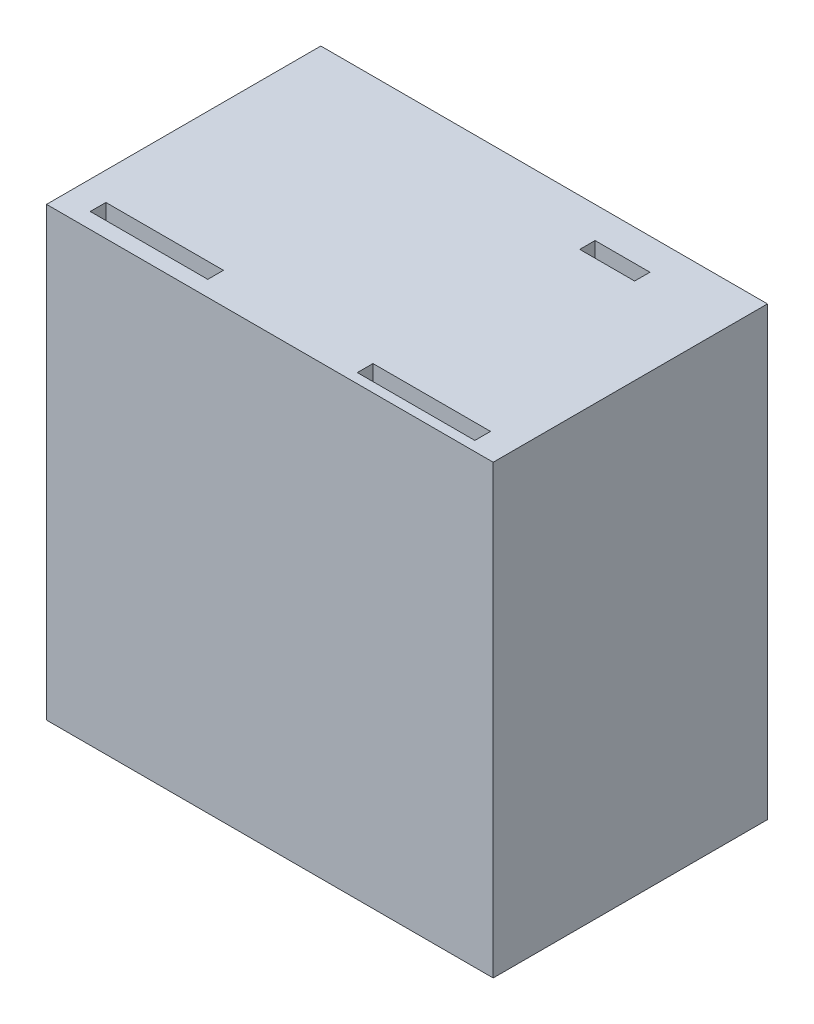
ISO-10303-21;
HEADER;
FILE_DESCRIPTION(('STEP AP214'),'2;1');
FILE_NAME('part.step','',(''),(''),'','','');
FILE_SCHEMA(('AUTOMOTIVE_DESIGN { 1 0 10303 214 1 1 1 1 }'));
ENDSEC;
DATA;
#1=APPLICATION_CONTEXT('core data for automotive mechanical design processes');
#2=APPLICATION_PROTOCOL_DEFINITION('international standard','automotive_design',2000,#1);
#3=PRODUCT_CONTEXT('',#1,'mechanical');
#4=PRODUCT('Part','Part','',(#3));
#5=PRODUCT_RELATED_PRODUCT_CATEGORY('part','',(#4));
#6=PRODUCT_DEFINITION_FORMATION('','',#4);
#7=PRODUCT_DEFINITION_CONTEXT('part definition',#1,'design');
#8=PRODUCT_DEFINITION('design','',#6,#7);
#9=PRODUCT_DEFINITION_SHAPE('','',#8);
#10=(LENGTH_UNIT() NAMED_UNIT(*) SI_UNIT(.MILLI.,.METRE.));
#11=(NAMED_UNIT(*) PLANE_ANGLE_UNIT() SI_UNIT($,.RADIAN.));
#12=(NAMED_UNIT(*) SI_UNIT($,.STERADIAN.) SOLID_ANGLE_UNIT());
#13=UNCERTAINTY_MEASURE_WITH_UNIT(LENGTH_MEASURE(1.E-05),#10,'distance_accuracy_value','');
#14=(GEOMETRIC_REPRESENTATION_CONTEXT(3) GLOBAL_UNCERTAINTY_ASSIGNED_CONTEXT((#13)) GLOBAL_UNIT_ASSIGNED_CONTEXT((#10,
#11,#12)) REPRESENTATION_CONTEXT('',''));
#15=CARTESIAN_POINT('',(0.,0.,0.));
#16=DIRECTION('',(0.,0.,1.));
#17=DIRECTION('',(1.,0.,0.));
#18=AXIS2_PLACEMENT_3D('',#15,#16,#17);
#19=CARTESIAN_POINT('',(0.,0.,0.));
#20=DIRECTION('',(0.,0.,1.));
#21=DIRECTION('',(1.,0.,0.));
#22=AXIS2_PLACEMENT_3D('',#19,#20,#21);
#23=PLANE('',#22);
#24=DIRECTION('',(0.,1.,0.));
#25=VECTOR('',#24,1.);
#26=CARTESIAN_POINT('',(-14.2330097087379,-26.7378640776699,0.));
#27=LINE('',#26,#25);
#28=CARTESIAN_POINT('',(-14.2330097087379,-29.2378640776699,0.));
#29=VERTEX_POINT('',#28);
#30=CARTESIAN_POINT('',(-14.2330097087379,-21.7378640776699,0.));
#31=VERTEX_POINT('',#30);
#32=EDGE_CURVE('E295',#29,#31,#27,.T.);
#33=ORIENTED_EDGE('',*,*,#32,.F.);
#34=DIRECTION('',(1.,0.,0.));
#35=VECTOR('',#34,1.);
#36=CARTESIAN_POINT('',(-34.2330097087379,-29.2378640776699,0.));
#37=LINE('',#36,#35);
#38=CARTESIAN_POINT('',(-34.2330097087379,-29.2378640776699,0.));
#39=VERTEX_POINT('',#38);
#40=EDGE_CURVE('E417',#39,#29,#37,.T.);
#41=ORIENTED_EDGE('',*,*,#40,.F.);
#42=DIRECTION('',(0.,-1.,0.));
#43=VECTOR('',#42,1.);
#44=CARTESIAN_POINT('',(-34.2330097087379,27.7621359223301,0.));
#45=LINE('',#44,#43);
#46=CARTESIAN_POINT('',(-34.2330097087379,-9.23786407766991,0.));
#47=VERTEX_POINT('',#46);
#48=EDGE_CURVE('E401',#47,#39,#45,.T.);
#49=ORIENTED_EDGE('',*,*,#48,.F.);
#50=DIRECTION('',(1.,0.,0.));
#51=VECTOR('',#50,1.);
#52=CARTESIAN_POINT('',(-36.7330097087378,-9.23786407766991,0.));
#53=LINE('',#52,#51);
#54=CARTESIAN_POINT('',(-26.7330097087379,-9.23786407766991,0.));
#55=VERTEX_POINT('',#54);
#56=EDGE_CURVE('E271',#47,#55,#53,.T.);
#57=ORIENTED_EDGE('',*,*,#56,.T.);
#58=DIRECTION('',(0.,1.,0.));
#59=VECTOR('',#58,1.);
#60=CARTESIAN_POINT('',(-26.7330097087379,20.2621359223301,0.));
#61=LINE('',#60,#59);
#62=CARTESIAN_POINT('',(-26.7330097087379,-21.7378640776699,0.));
#63=VERTEX_POINT('',#62);
#64=EDGE_CURVE('E322',#63,#55,#61,.T.);
#65=ORIENTED_EDGE('',*,*,#64,.F.);
#66=DIRECTION('',(-1.,0.,0.));
#67=VECTOR('',#66,1.);
#68=CARTESIAN_POINT('',(15.2669902912621,-21.7378640776699,0.));
#69=LINE('',#68,#67);
#70=EDGE_CURVE('E317',#31,#63,#69,.T.);
#71=ORIENTED_EDGE('',*,*,#70,.F.);
#72=EDGE_LOOP('',(#33,#41,#49,#57,#65,#71));
#73=FACE_BOUND('',#72,.T.);
#74=ADVANCED_FACE('F36',(#73),#23,.F.);
#75=CARTESIAN_POINT('',(-34.2330097087379,27.7621359223301,35.));
#76=DIRECTION('',(1.,0.,0.));
#77=DIRECTION('',(0.,0.,-1.));
#78=AXIS2_PLACEMENT_3D('',#75,#76,#77);
#79=PLANE('',#78);
#80=CARTESIAN_POINT('',(-34.2330097087379,27.7621359223301,0.));
#81=VERTEX_POINT('',#80);
#82=CARTESIAN_POINT('',(-34.2330097087379,7.7621359223301,0.));
#83=VERTEX_POINT('',#82);
#84=EDGE_CURVE('E413',#81,#83,#45,.T.);
#85=ORIENTED_EDGE('',*,*,#84,.T.);
#86=DIRECTION('',(0.,0.,1.));
#87=VECTOR('',#86,1.);
#88=CARTESIAN_POINT('',(-34.2330097087379,7.76213592233009,35.));
#89=LINE('',#88,#87);
#90=CARTESIAN_POINT('',(-34.2330097087379,7.7621359223301,11.));
#91=VERTEX_POINT('',#90);
#92=EDGE_CURVE('E278',#83,#91,#89,.T.);
#93=ORIENTED_EDGE('',*,*,#92,.T.);
#94=CARTESIAN_POINT('',(-34.2330097087379,-0.737864077669904,11.));
#95=DIRECTION('',(1.,0.,0.));
#96=DIRECTION('',(0.,0.,-1.));
#97=AXIS2_PLACEMENT_3D('',#94,#95,#96);
#98=CIRCLE('',#97,8.5);
#99=CARTESIAN_POINT('',(-34.2330097087379,-9.23786407766991,11.));
#100=VERTEX_POINT('',#99);
#101=EDGE_CURVE('E281',#91,#100,#98,.T.);
#102=ORIENTED_EDGE('',*,*,#101,.T.);
#103=DIRECTION('',(0.,0.,-1.));
#104=VECTOR('',#103,1.);
#105=CARTESIAN_POINT('',(-34.2330097087379,-9.23786407766991,35.));
#106=LINE('',#105,#104);
#107=EDGE_CURVE('E268',#100,#47,#106,.T.);
#108=ORIENTED_EDGE('',*,*,#107,.T.);
#109=ORIENTED_EDGE('',*,*,#48,.T.);
#110=DIRECTION('',(0.,0.,-1.));
#111=VECTOR('',#110,1.);
#112=CARTESIAN_POINT('',(-34.2330097087379,-29.2378640776699,35.));
#113=LINE('',#112,#111);
#114=CARTESIAN_POINT('',(-34.2330097087379,-29.2378640776699,35.));
#115=VERTEX_POINT('',#114);
#116=EDGE_CURVE('E431',#115,#39,#113,.T.);
#117=ORIENTED_EDGE('',*,*,#116,.F.);
#118=DIRECTION('',(0.,-1.,0.));
#119=VECTOR('',#118,1.);
#120=CARTESIAN_POINT('',(-34.2330097087379,27.7621359223301,35.));
#121=LINE('',#120,#119);
#122=CARTESIAN_POINT('',(-34.2330097087379,27.7621359223301,35.));
#123=VERTEX_POINT('',#122);
#124=EDGE_CURVE('E402',#123,#115,#121,.T.);
#125=ORIENTED_EDGE('',*,*,#124,.F.);
#126=DIRECTION('',(0.,0.,-1.));
#127=VECTOR('',#126,1.);
#128=CARTESIAN_POINT('',(-34.2330097087379,27.7621359223301,35.));
#129=LINE('',#128,#127);
#130=EDGE_CURVE('E412',#123,#81,#129,.T.);
#131=ORIENTED_EDGE('',*,*,#130,.T.);
#132=EDGE_LOOP('',(#85,#93,#102,#108,#109,#117,#125,#131));
#133=FACE_BOUND('',#132,.T.);
#134=ADVANCED_FACE('F38',(#133),#79,.F.);
#135=CARTESIAN_POINT('',(-34.2330097087379,-29.2378640776699,35.));
#136=DIRECTION('',(0.,1.,0.));
#137=DIRECTION('',(0.,0.,1.));
#138=AXIS2_PLACEMENT_3D('',#135,#136,#137);
#139=PLANE('',#138);
#140=DIRECTION('',(-1.,0.,0.));
#141=VECTOR('',#140,1.);
#142=CARTESIAN_POINT('',(-34.2330097087379,-29.2378640776699,31.));
#143=LINE('',#142,#141);
#144=CARTESIAN_POINT('',(-15.6564162838043,-29.2378640776699,31.));
#145=VERTEX_POINT('',#144);
#146=CARTESIAN_POINT('',(-30.6564162838043,-29.2378640776699,31.));
#147=VERTEX_POINT('',#146);
#148=EDGE_CURVE('E395',#145,#147,#143,.T.);
#149=ORIENTED_EDGE('',*,*,#148,.T.);
#150=DIRECTION('',(0.,0.,1.));
#151=VECTOR('',#150,1.);
#152=CARTESIAN_POINT('',(-30.6564162838043,-29.2378640776699,35.));
#153=LINE('',#152,#151);
#154=CARTESIAN_POINT('',(-30.6564162838043,-29.2378640776699,33.));
#155=VERTEX_POINT('',#154);
#156=EDGE_CURVE('E398',#147,#155,#153,.T.);
#157=ORIENTED_EDGE('',*,*,#156,.T.);
#158=DIRECTION('',(1.,0.,0.));
#159=VECTOR('',#158,1.);
#160=CARTESIAN_POINT('',(-34.2330097087379,-29.2378640776699,33.));
#161=LINE('',#160,#159);
#162=CARTESIAN_POINT('',(-15.6564162838043,-29.2378640776699,33.));
#163=VERTEX_POINT('',#162);
#164=EDGE_CURVE('E389',#155,#163,#161,.T.);
#165=ORIENTED_EDGE('',*,*,#164,.T.);
#166=DIRECTION('',(0.,0.,-1.));
#167=VECTOR('',#166,1.);
#168=CARTESIAN_POINT('',(-15.6564162838043,-29.2378640776699,35.));
#169=LINE('',#168,#167);
#170=EDGE_CURVE('E392',#163,#145,#169,.T.);
#171=ORIENTED_EDGE('',*,*,#170,.T.);
#172=EDGE_LOOP('',(#149,#157,#165,#171));
#173=FACE_BOUND('',#172,.T.);
#174=DIRECTION('',(-1.,0.,0.));
#175=VECTOR('',#174,1.);
#176=CARTESIAN_POINT('',(-34.2330097087379,-29.2378640776699,31.7612090318088));
#177=LINE('',#176,#175);
#178=CARTESIAN_POINT('',(19.1869902912621,-29.2378640776699,31.7612090318088));
#179=VERTEX_POINT('',#178);
#180=CARTESIAN_POINT('',(4.18699029126214,-29.2378640776699,31.7612090318088));
#181=VERTEX_POINT('',#180);
#182=EDGE_CURVE('E383',#179,#181,#177,.T.);
#183=ORIENTED_EDGE('',*,*,#182,.T.);
#184=DIRECTION('',(0.,0.,1.));
#185=VECTOR('',#184,1.);
#186=CARTESIAN_POINT('',(4.18699029126214,-29.2378640776699,35.));
#187=LINE('',#186,#185);
#188=CARTESIAN_POINT('',(4.18699029126214,-29.2378640776699,33.7612090318088));
#189=VERTEX_POINT('',#188);
#190=EDGE_CURVE('E386',#181,#189,#187,.T.);
#191=ORIENTED_EDGE('',*,*,#190,.T.);
#192=DIRECTION('',(1.,0.,0.));
#193=VECTOR('',#192,1.);
#194=CARTESIAN_POINT('',(-34.2330097087379,-29.2378640776699,33.7612090318088));
#195=LINE('',#194,#193);
#196=CARTESIAN_POINT('',(19.1869902912621,-29.2378640776699,33.7612090318088));
#197=VERTEX_POINT('',#196);
#198=EDGE_CURVE('E353',#189,#197,#195,.T.);
#199=ORIENTED_EDGE('',*,*,#198,.T.);
#200=DIRECTION('',(0.,0.,-1.));
#201=VECTOR('',#200,1.);
#202=CARTESIAN_POINT('',(19.1869902912621,-29.2378640776699,35.));
#203=LINE('',#202,#201);
#204=EDGE_CURVE('E380',#197,#179,#203,.T.);
#205=ORIENTED_EDGE('',*,*,#204,.T.);
#206=EDGE_LOOP('',(#183,#191,#199,#205));
#207=FACE_BOUND('',#206,.T.);
#208=ORIENTED_EDGE('',*,*,#40,.T.);
#209=DIRECTION('',(0.,0.,1.));
#210=VECTOR('',#209,1.);
#211=CARTESIAN_POINT('',(-14.2330097087378,-29.2378640776699,35.));
#212=LINE('',#211,#210);
#213=CARTESIAN_POINT('',(-14.2330097087379,-29.2378640776699,11.));
#214=VERTEX_POINT('',#213);
#215=EDGE_CURVE('E252',#29,#214,#212,.T.);
#216=ORIENTED_EDGE('',*,*,#215,.T.);
#217=CARTESIAN_POINT('',(-5.73300970873786,-29.2378640776699,11.));
#218=DIRECTION('',(0.,1.,0.));
#219=DIRECTION('',(0.,0.,1.));
#220=AXIS2_PLACEMENT_3D('',#217,#218,#219);
#221=CIRCLE('',#220,8.5);
#222=CARTESIAN_POINT('',(2.76699029126214,-29.2378640776699,11.));
#223=VERTEX_POINT('',#222);
#224=EDGE_CURVE('E255',#214,#223,#221,.T.);
#225=ORIENTED_EDGE('',*,*,#224,.T.);
#226=DIRECTION('',(0.,0.,-1.));
#227=VECTOR('',#226,1.);
#228=CARTESIAN_POINT('',(2.76699029126214,-29.2378640776699,35.));
#229=LINE('',#228,#227);
#230=CARTESIAN_POINT('',(2.76699029126214,-29.2378640776699,0.));
#231=VERTEX_POINT('',#230);
#232=EDGE_CURVE('E247',#223,#231,#229,.T.);
#233=ORIENTED_EDGE('',*,*,#232,.T.);
#234=CARTESIAN_POINT('',(22.7669902912621,-29.2378640776699,0.));
#235=VERTEX_POINT('',#234);
#236=EDGE_CURVE('E416',#231,#235,#37,.T.);
#237=ORIENTED_EDGE('',*,*,#236,.T.);
#238=DIRECTION('',(0.,0.,-1.));
#239=VECTOR('',#238,1.);
#240=CARTESIAN_POINT('',(22.7669902912621,-29.2378640776699,35.));
#241=LINE('',#240,#239);
#242=CARTESIAN_POINT('',(22.7669902912621,-29.2378640776699,35.));
#243=VERTEX_POINT('',#242);
#244=EDGE_CURVE('E428',#243,#235,#241,.T.);
#245=ORIENTED_EDGE('',*,*,#244,.F.);
#246=DIRECTION('',(1.,0.,0.));
#247=VECTOR('',#246,1.);
#248=CARTESIAN_POINT('',(-34.2330097087379,-29.2378640776699,35.));
#249=LINE('',#248,#247);
#250=EDGE_CURVE('E405',#115,#243,#249,.T.);
#251=ORIENTED_EDGE('',*,*,#250,.F.);
#252=ORIENTED_EDGE('',*,*,#116,.T.);
#253=EDGE_LOOP('',(#208,#216,#225,#233,#237,#245,#251,#252));
#254=FACE_BOUND('',#253,.T.);
#255=ADVANCED_FACE('F464',(#173,#207,#254),#139,.F.);
#256=CARTESIAN_POINT('',(22.7669902912621,27.7621359223301,35.));
#257=DIRECTION('',(-1.,0.,0.));
#258=DIRECTION('',(0.,-1.,0.));
#259=AXIS2_PLACEMENT_3D('',#256,#257,#258);
#260=PLANE('',#259);
#261=DIRECTION('',(0.,1.,0.));
#262=VECTOR('',#261,1.);
#263=CARTESIAN_POINT('',(22.7669902912621,27.7621359223301,0.));
#264=LINE('',#263,#262);
#265=CARTESIAN_POINT('',(22.7669902912621,27.7621359223301,0.));
#266=VERTEX_POINT('',#265);
#267=EDGE_CURVE('E420',#235,#266,#264,.T.);
#268=ORIENTED_EDGE('',*,*,#267,.T.);
#269=DIRECTION('',(0.,0.,-1.));
#270=VECTOR('',#269,1.);
#271=CARTESIAN_POINT('',(22.7669902912621,27.7621359223301,35.));
#272=LINE('',#271,#270);
#273=CARTESIAN_POINT('',(22.7669902912621,27.7621359223301,35.));
#274=VERTEX_POINT('',#273);
#275=EDGE_CURVE('E425',#274,#266,#272,.T.);
#276=ORIENTED_EDGE('',*,*,#275,.F.);
#277=DIRECTION('',(0.,1.,0.));
#278=VECTOR('',#277,1.);
#279=CARTESIAN_POINT('',(22.7669902912621,27.7621359223301,35.));
#280=LINE('',#279,#278);
#281=EDGE_CURVE('E408',#243,#274,#280,.T.);
#282=ORIENTED_EDGE('',*,*,#281,.F.);
#283=ORIENTED_EDGE('',*,*,#244,.T.);
#284=EDGE_LOOP('',(#268,#276,#282,#283));
#285=FACE_BOUND('',#284,.T.);
#286=ADVANCED_FACE('F489',(#285),#260,.F.);
#287=CARTESIAN_POINT('',(-34.2330097087379,27.7621359223301,35.));
#288=DIRECTION('',(0.,-1.,0.));
#289=DIRECTION('',(0.,0.,-1.));
#290=AXIS2_PLACEMENT_3D('',#287,#288,#289);
#291=PLANE('',#290);
#292=DIRECTION('',(1.,0.,0.));
#293=VECTOR('',#292,1.);
#294=CARTESIAN_POINT('',(4.76699029126214,27.7621359223301,5.95256684431433));
#295=LINE('',#294,#293);
#296=CARTESIAN_POINT('',(4.76699029126214,27.7621359223301,5.95256684431433));
#297=VERTEX_POINT('',#296);
#298=CARTESIAN_POINT('',(11.7669902912621,27.7621359223301,5.95256684431433));
#299=VERTEX_POINT('',#298);
#300=EDGE_CURVE('E233',#297,#299,#295,.T.);
#301=ORIENTED_EDGE('',*,*,#300,.F.);
#302=DIRECTION('',(0.,0.,1.));
#303=VECTOR('',#302,1.);
#304=CARTESIAN_POINT('',(4.7669902912621,27.7621359223301,4.));
#305=LINE('',#304,#303);
#306=CARTESIAN_POINT('',(4.7669902912621,27.7621359223301,4.));
#307=VERTEX_POINT('',#306);
#308=EDGE_CURVE('E51',#307,#297,#305,.T.);
#309=ORIENTED_EDGE('',*,*,#308,.F.);
#310=DIRECTION('',(-1.,0.,0.));
#311=VECTOR('',#310,1.);
#312=CARTESIAN_POINT('',(4.7669902912621,27.7621359223301,4.));
#313=LINE('',#312,#311);
#314=CARTESIAN_POINT('',(11.7669902912621,27.7621359223301,4.));
#315=VERTEX_POINT('',#314);
#316=EDGE_CURVE('E240',#315,#307,#313,.T.);
#317=ORIENTED_EDGE('',*,*,#316,.F.);
#318=DIRECTION('',(0.,0.,-1.));
#319=VECTOR('',#318,1.);
#320=CARTESIAN_POINT('',(11.7669902912621,27.7621359223301,4.));
#321=LINE('',#320,#319);
#322=EDGE_CURVE('E224',#299,#315,#321,.T.);
#323=ORIENTED_EDGE('',*,*,#322,.F.);
#324=EDGE_LOOP('',(#301,#309,#317,#323));
#325=FACE_BOUND('',#324,.T.);
#326=DIRECTION('',(1.,0.,0.));
#327=VECTOR('',#326,1.);
#328=CARTESIAN_POINT('',(-30.6564162838043,27.7621359223301,33.));
#329=LINE('',#328,#327);
#330=CARTESIAN_POINT('',(-30.6564162838043,27.7621359223301,33.));
#331=VERTEX_POINT('',#330);
#332=CARTESIAN_POINT('',(-15.6564162838043,27.7621359223301,33.));
#333=VERTEX_POINT('',#332);
#334=EDGE_CURVE('E340',#331,#333,#329,.T.);
#335=ORIENTED_EDGE('',*,*,#334,.F.);
#336=DIRECTION('',(0.,0.,1.));
#337=VECTOR('',#336,1.);
#338=CARTESIAN_POINT('',(-30.6564162838043,27.7621359223301,31.));
#339=LINE('',#338,#337);
#340=CARTESIAN_POINT('',(-30.6564162838043,27.7621359223301,31.));
#341=VERTEX_POINT('',#340);
#342=EDGE_CURVE('E338',#341,#331,#339,.T.);
#343=ORIENTED_EDGE('',*,*,#342,.F.);
#344=DIRECTION('',(-1.,0.,0.));
#345=VECTOR('',#344,1.);
#346=CARTESIAN_POINT('',(-30.6564162838043,27.7621359223301,31.));
#347=LINE('',#346,#345);
#348=CARTESIAN_POINT('',(-15.6564162838043,27.7621359223301,31.));
#349=VERTEX_POINT('',#348);
#350=EDGE_CURVE('E347',#349,#341,#347,.T.);
#351=ORIENTED_EDGE('',*,*,#350,.F.);
#352=DIRECTION('',(0.,0.,-1.));
#353=VECTOR('',#352,1.);
#354=CARTESIAN_POINT('',(-15.6564162838043,27.7621359223301,31.));
#355=LINE('',#354,#353);
#356=EDGE_CURVE('E344',#333,#349,#355,.T.);
#357=ORIENTED_EDGE('',*,*,#356,.F.);
#358=EDGE_LOOP('',(#335,#343,#351,#357));
#359=FACE_BOUND('',#358,.T.);
#360=DIRECTION('',(1.,0.,0.));
#361=VECTOR('',#360,1.);
#362=CARTESIAN_POINT('',(4.18699029126214,27.7621359223301,33.7612090318088));
#363=LINE('',#362,#361);
#364=CARTESIAN_POINT('',(4.18699029126214,27.7621359223301,33.7612090318088));
#365=VERTEX_POINT('',#364);
#366=CARTESIAN_POINT('',(19.1869902912621,27.7621359223301,33.7612090318088));
#367=VERTEX_POINT('',#366);
#368=EDGE_CURVE('E361',#365,#367,#363,.T.);
#369=ORIENTED_EDGE('',*,*,#368,.F.);
#370=DIRECTION('',(0.,0.,1.));
#371=VECTOR('',#370,1.);
#372=CARTESIAN_POINT('',(4.18699029126214,27.7621359223301,31.7612090318088));
#373=LINE('',#372,#371);
#374=CARTESIAN_POINT('',(4.18699029126214,27.7621359223301,31.7612090318088));
#375=VERTEX_POINT('',#374);
#376=EDGE_CURVE('E329',#375,#365,#373,.T.);
#377=ORIENTED_EDGE('',*,*,#376,.F.);
#378=DIRECTION('',(-1.,0.,0.));
#379=VECTOR('',#378,1.);
#380=CARTESIAN_POINT('',(4.18699029126214,27.7621359223301,31.7612090318088));
#381=LINE('',#380,#379);
#382=CARTESIAN_POINT('',(19.1869902912621,27.7621359223301,31.7612090318088));
#383=VERTEX_POINT('',#382);
#384=EDGE_CURVE('E367',#383,#375,#381,.T.);
#385=ORIENTED_EDGE('',*,*,#384,.F.);
#386=DIRECTION('',(0.,0.,-1.));
#387=VECTOR('',#386,1.);
#388=CARTESIAN_POINT('',(19.1869902912621,27.7621359223301,31.7612090318088));
#389=LINE('',#388,#387);
#390=EDGE_CURVE('E364',#367,#383,#389,.T.);
#391=ORIENTED_EDGE('',*,*,#390,.F.);
#392=EDGE_LOOP('',(#369,#377,#385,#391));
#393=FACE_BOUND('',#392,.T.);
#394=DIRECTION('',(-1.,0.,0.));
#395=VECTOR('',#394,1.);
#396=CARTESIAN_POINT('',(-34.2330097087379,27.7621359223301,0.));
#397=LINE('',#396,#395);
#398=EDGE_CURVE('E406',#266,#81,#397,.T.);
#399=ORIENTED_EDGE('',*,*,#398,.T.);
#400=ORIENTED_EDGE('',*,*,#130,.F.);
#401=DIRECTION('',(-1.,0.,0.));
#402=VECTOR('',#401,1.);
#403=CARTESIAN_POINT('',(-34.2330097087379,27.7621359223301,35.));
#404=LINE('',#403,#402);
#405=EDGE_CURVE('E410',#274,#123,#404,.T.);
#406=ORIENTED_EDGE('',*,*,#405,.F.);
#407=ORIENTED_EDGE('',*,*,#275,.T.);
#408=EDGE_LOOP('',(#399,#400,#406,#407));
#409=FACE_BOUND('',#408,.T.);
#410=ADVANCED_FACE('F237',(#325,#359,#393,#409),#291,.F.);
#411=CARTESIAN_POINT('',(0.,0.,35.));
#412=DIRECTION('',(0.,0.,1.));
#413=DIRECTION('',(1.,0.,0.));
#414=AXIS2_PLACEMENT_3D('',#411,#412,#413);
#415=PLANE('',#414);
#416=ORIENTED_EDGE('',*,*,#124,.T.);
#417=ORIENTED_EDGE('',*,*,#250,.T.);
#418=ORIENTED_EDGE('',*,*,#281,.T.);
#419=ORIENTED_EDGE('',*,*,#405,.T.);
#420=EDGE_LOOP('',(#416,#417,#418,#419));
#421=FACE_BOUND('',#420,.T.);
#422=ADVANCED_FACE('F470',(#421),#415,.T.);
#423=ORIENTED_EDGE('',*,*,#236,.F.);
#424=DIRECTION('',(0.,1.,0.));
#425=VECTOR('',#424,1.);
#426=CARTESIAN_POINT('',(2.76699029126214,-26.7378640776699,0.));
#427=LINE('',#426,#425);
#428=CARTESIAN_POINT('',(2.76699029126214,-21.7378640776699,0.));
#429=VERTEX_POINT('',#428);
#430=EDGE_CURVE('E297',#231,#429,#427,.T.);
#431=ORIENTED_EDGE('',*,*,#430,.T.);
#432=CARTESIAN_POINT('',(15.2669902912621,-21.7378640776699,0.));
#433=VERTEX_POINT('',#432);
#434=EDGE_CURVE('E318',#433,#429,#69,.T.);
#435=ORIENTED_EDGE('',*,*,#434,.F.);
#436=DIRECTION('',(0.,-1.,0.));
#437=VECTOR('',#436,1.);
#438=CARTESIAN_POINT('',(15.2669902912621,20.2621359223301,0.));
#439=LINE('',#438,#437);
#440=CARTESIAN_POINT('',(15.2669902912621,20.2621359223301,0.));
#441=VERTEX_POINT('',#440);
#442=EDGE_CURVE('E294',#441,#433,#439,.T.);
#443=ORIENTED_EDGE('',*,*,#442,.F.);
#444=DIRECTION('',(1.,0.,0.));
#445=VECTOR('',#444,1.);
#446=CARTESIAN_POINT('',(15.2669902912621,20.2621359223301,0.));
#447=LINE('',#446,#445);
#448=CARTESIAN_POINT('',(-26.7330097087379,20.2621359223301,0.));
#449=VERTEX_POINT('',#448);
#450=EDGE_CURVE('E306',#449,#441,#447,.T.);
#451=ORIENTED_EDGE('',*,*,#450,.F.);
#452=CARTESIAN_POINT('',(-26.7330097087379,7.7621359223301,0.));
#453=VERTEX_POINT('',#452);
#454=EDGE_CURVE('E321',#453,#449,#61,.T.);
#455=ORIENTED_EDGE('',*,*,#454,.F.);
#456=DIRECTION('',(1.,0.,0.));
#457=VECTOR('',#456,1.);
#458=CARTESIAN_POINT('',(-36.7330097087378,7.7621359223301,0.));
#459=LINE('',#458,#457);
#460=EDGE_CURVE('E269',#83,#453,#459,.T.);
#461=ORIENTED_EDGE('',*,*,#460,.F.);
#462=ORIENTED_EDGE('',*,*,#84,.F.);
#463=ORIENTED_EDGE('',*,*,#398,.F.);
#464=ORIENTED_EDGE('',*,*,#267,.F.);
#465=EDGE_LOOP('',(#423,#431,#435,#443,#451,#455,#461,#462,#463,#464));
#466=FACE_BOUND('',#465,.T.);
#467=ADVANCED_FACE('F460',(#466),#23,.F.);
#468=CARTESIAN_POINT('',(4.18699029126214,-32.2378640776699,31.7612090318088));
#469=DIRECTION('',(-1.,0.,0.));
#470=DIRECTION('',(0.,0.,1.));
#471=AXIS2_PLACEMENT_3D('',#468,#469,#470);
#472=PLANE('',#471);
#473=DIRECTION('',(0.,1.,0.));
#474=VECTOR('',#473,1.);
#475=CARTESIAN_POINT('',(4.18699029126214,-32.2378640776699,31.7612090318088));
#476=LINE('',#475,#474);
#477=EDGE_CURVE('E341',#181,#375,#476,.T.);
#478=ORIENTED_EDGE('',*,*,#477,.T.);
#479=ORIENTED_EDGE('',*,*,#376,.T.);
#480=DIRECTION('',(0.,1.,0.));
#481=VECTOR('',#480,1.);
#482=CARTESIAN_POINT('',(4.18699029126214,-32.2378640776699,33.7612090318088));
#483=LINE('',#482,#481);
#484=EDGE_CURVE('E370',#189,#365,#483,.T.);
#485=ORIENTED_EDGE('',*,*,#484,.F.);
#486=ORIENTED_EDGE('',*,*,#190,.F.);
#487=EDGE_LOOP('',(#478,#479,#485,#486));
#488=FACE_BOUND('',#487,.T.);
#489=ADVANCED_FACE('F469',(#488),#472,.F.);
#490=CARTESIAN_POINT('',(4.18699029126214,-32.2378640776699,31.7612090318088));
#491=DIRECTION('',(0.,0.,-1.));
#492=DIRECTION('',(-1.,0.,0.));
#493=AXIS2_PLACEMENT_3D('',#490,#491,#492);
#494=PLANE('',#493);
#495=DIRECTION('',(0.,1.,0.));
#496=VECTOR('',#495,1.);
#497=CARTESIAN_POINT('',(19.1869902912621,-32.2378640776699,31.7612090318088));
#498=LINE('',#497,#496);
#499=EDGE_CURVE('E372',#179,#383,#498,.T.);
#500=ORIENTED_EDGE('',*,*,#499,.T.);
#501=ORIENTED_EDGE('',*,*,#384,.T.);
#502=ORIENTED_EDGE('',*,*,#477,.F.);
#503=ORIENTED_EDGE('',*,*,#182,.F.);
#504=EDGE_LOOP('',(#500,#501,#502,#503));
#505=FACE_BOUND('',#504,.T.);
#506=ADVANCED_FACE('F476',(#505),#494,.F.);
#507=CARTESIAN_POINT('',(19.1869902912621,-32.2378640776699,31.7612090318088));
#508=DIRECTION('',(1.,0.,0.));
#509=DIRECTION('',(0.,0.,-1.));
#510=AXIS2_PLACEMENT_3D('',#507,#508,#509);
#511=PLANE('',#510);
#512=DIRECTION('',(0.,1.,0.));
#513=VECTOR('',#512,1.);
#514=CARTESIAN_POINT('',(19.1869902912621,-32.2378640776699,33.7612090318088));
#515=LINE('',#514,#513);
#516=EDGE_CURVE('E374',#197,#367,#515,.T.);
#517=ORIENTED_EDGE('',*,*,#516,.T.);
#518=ORIENTED_EDGE('',*,*,#390,.T.);
#519=ORIENTED_EDGE('',*,*,#499,.F.);
#520=ORIENTED_EDGE('',*,*,#204,.F.);
#521=EDGE_LOOP('',(#517,#518,#519,#520));
#522=FACE_BOUND('',#521,.T.);
#523=ADVANCED_FACE('F551',(#522),#511,.F.);
#524=CARTESIAN_POINT('',(4.18699029126214,-32.2378640776699,33.7612090318088));
#525=DIRECTION('',(0.,0.,1.));
#526=DIRECTION('',(1.,0.,0.));
#527=AXIS2_PLACEMENT_3D('',#524,#525,#526);
#528=PLANE('',#527);
#529=ORIENTED_EDGE('',*,*,#484,.T.);
#530=ORIENTED_EDGE('',*,*,#368,.T.);
#531=ORIENTED_EDGE('',*,*,#516,.F.);
#532=ORIENTED_EDGE('',*,*,#198,.F.);
#533=EDGE_LOOP('',(#529,#530,#531,#532));
#534=FACE_BOUND('',#533,.T.);
#535=ADVANCED_FACE('F559',(#534),#528,.F.);
#536=CARTESIAN_POINT('',(-30.6564162838043,-32.2378640776699,31.));
#537=DIRECTION('',(-1.,0.,0.));
#538=DIRECTION('',(0.,0.,1.));
#539=AXIS2_PLACEMENT_3D('',#536,#537,#538);
#540=PLANE('',#539);
#541=DIRECTION('',(0.,1.,0.));
#542=VECTOR('',#541,1.);
#543=CARTESIAN_POINT('',(-30.6564162838043,-32.2378640776699,31.));
#544=LINE('',#543,#542);
#545=EDGE_CURVE('E351',#147,#341,#544,.T.);
#546=ORIENTED_EDGE('',*,*,#545,.T.);
#547=ORIENTED_EDGE('',*,*,#342,.T.);
#548=DIRECTION('',(0.,1.,0.));
#549=VECTOR('',#548,1.);
#550=CARTESIAN_POINT('',(-30.6564162838043,-32.2378640776699,33.));
#551=LINE('',#550,#549);
#552=EDGE_CURVE('E350',#155,#331,#551,.T.);
#553=ORIENTED_EDGE('',*,*,#552,.F.);
#554=ORIENTED_EDGE('',*,*,#156,.F.);
#555=EDGE_LOOP('',(#546,#547,#553,#554));
#556=FACE_BOUND('',#555,.T.);
#557=ADVANCED_FACE('F561',(#556),#540,.F.);
#558=CARTESIAN_POINT('',(-30.6564162838043,-32.2378640776699,31.));
#559=DIRECTION('',(0.,0.,-1.));
#560=DIRECTION('',(-1.,0.,0.));
#561=AXIS2_PLACEMENT_3D('',#558,#559,#560);
#562=PLANE('',#561);
#563=DIRECTION('',(0.,1.,0.));
#564=VECTOR('',#563,1.);
#565=CARTESIAN_POINT('',(-15.6564162838043,-32.2378640776699,31.));
#566=LINE('',#565,#564);
#567=EDGE_CURVE('E354',#145,#349,#566,.T.);
#568=ORIENTED_EDGE('',*,*,#567,.T.);
#569=ORIENTED_EDGE('',*,*,#350,.T.);
#570=ORIENTED_EDGE('',*,*,#545,.F.);
#571=ORIENTED_EDGE('',*,*,#148,.F.);
#572=EDGE_LOOP('',(#568,#569,#570,#571));
#573=FACE_BOUND('',#572,.T.);
#574=ADVANCED_FACE('F567',(#573),#562,.F.);
#575=CARTESIAN_POINT('',(-15.6564162838043,-32.2378640776699,31.));
#576=DIRECTION('',(1.,0.,0.));
#577=DIRECTION('',(0.,0.,-1.));
#578=AXIS2_PLACEMENT_3D('',#575,#576,#577);
#579=PLANE('',#578);
#580=DIRECTION('',(0.,1.,0.));
#581=VECTOR('',#580,1.);
#582=CARTESIAN_POINT('',(-15.6564162838043,-32.2378640776699,33.));
#583=LINE('',#582,#581);
#584=EDGE_CURVE('E356',#163,#333,#583,.T.);
#585=ORIENTED_EDGE('',*,*,#584,.T.);
#586=ORIENTED_EDGE('',*,*,#356,.T.);
#587=ORIENTED_EDGE('',*,*,#567,.F.);
#588=ORIENTED_EDGE('',*,*,#170,.F.);
#589=EDGE_LOOP('',(#585,#586,#587,#588));
#590=FACE_BOUND('',#589,.T.);
#591=ADVANCED_FACE('F577',(#590),#579,.F.);
#592=CARTESIAN_POINT('',(-30.6564162838043,-32.2378640776699,33.));
#593=DIRECTION('',(0.,0.,1.));
#594=DIRECTION('',(1.,0.,0.));
#595=AXIS2_PLACEMENT_3D('',#592,#593,#594);
#596=PLANE('',#595);
#597=ORIENTED_EDGE('',*,*,#552,.T.);
#598=ORIENTED_EDGE('',*,*,#334,.T.);
#599=ORIENTED_EDGE('',*,*,#584,.F.);
#600=ORIENTED_EDGE('',*,*,#164,.F.);
#601=EDGE_LOOP('',(#597,#598,#599,#600));
#602=FACE_BOUND('',#601,.T.);
#603=ADVANCED_FACE('F574',(#602),#596,.F.);
#604=CARTESIAN_POINT('',(15.2669902912621,20.2621359223301,28.));
#605=DIRECTION('',(1.,0.,0.));
#606=DIRECTION('',(0.,1.,0.));
#607=AXIS2_PLACEMENT_3D('',#604,#605,#606);
#608=PLANE('',#607);
#609=ORIENTED_EDGE('',*,*,#442,.T.);
#610=DIRECTION('',(0.,0.,-1.));
#611=VECTOR('',#610,1.);
#612=CARTESIAN_POINT('',(15.2669902912621,-21.7378640776699,28.));
#613=LINE('',#612,#611);
#614=CARTESIAN_POINT('',(15.2669902912621,-21.7378640776699,28.));
#615=VERTEX_POINT('',#614);
#616=EDGE_CURVE('E315',#615,#433,#613,.T.);
#617=ORIENTED_EDGE('',*,*,#616,.F.);
#618=DIRECTION('',(0.,-1.,0.));
#619=VECTOR('',#618,1.);
#620=CARTESIAN_POINT('',(15.2669902912621,20.2621359223301,28.));
#621=LINE('',#620,#619);
#622=CARTESIAN_POINT('',(15.2669902912621,20.2621359223301,28.));
#623=VERTEX_POINT('',#622);
#624=EDGE_CURVE('E302',#623,#615,#621,.T.);
#625=ORIENTED_EDGE('',*,*,#624,.F.);
#626=DIRECTION('',(0.,0.,-1.));
#627=VECTOR('',#626,1.);
#628=CARTESIAN_POINT('',(15.2669902912621,20.2621359223301,28.));
#629=LINE('',#628,#627);
#630=EDGE_CURVE('E327',#623,#441,#629,.T.);
#631=ORIENTED_EDGE('',*,*,#630,.T.);
#632=EDGE_LOOP('',(#609,#617,#625,#631));
#633=FACE_BOUND('',#632,.T.);
#634=ADVANCED_FACE('F517',(#633),#608,.F.);
#635=CARTESIAN_POINT('',(15.2669902912621,20.2621359223301,28.));
#636=DIRECTION('',(0.,1.,0.));
#637=DIRECTION('',(0.,0.,1.));
#638=AXIS2_PLACEMENT_3D('',#635,#636,#637);
#639=PLANE('',#638);
#640=DIRECTION('',(-1.,0.,0.));
#641=VECTOR('',#640,1.);
#642=CARTESIAN_POINT('',(15.2669902912621,20.2621359223301,4.));
#643=LINE('',#642,#641);
#644=CARTESIAN_POINT('',(11.7669902912621,20.2621359223301,4.));
#645=VERTEX_POINT('',#644);
#646=CARTESIAN_POINT('',(4.7669902912621,20.2621359223301,4.));
#647=VERTEX_POINT('',#646);
#648=EDGE_CURVE('E44',#645,#647,#643,.T.);
#649=ORIENTED_EDGE('',*,*,#648,.T.);
#650=DIRECTION('',(0.,0.,1.));
#651=VECTOR('',#650,1.);
#652=CARTESIAN_POINT('',(4.76699029126256,20.2621359223301,28.0000000000002));
#653=LINE('',#652,#651);
#654=CARTESIAN_POINT('',(4.76699029126214,20.2621359223301,5.95256684431433));
#655=VERTEX_POINT('',#654);
#656=EDGE_CURVE('E11',#647,#655,#653,.T.);
#657=ORIENTED_EDGE('',*,*,#656,.T.);
#658=DIRECTION('',(1.,0.,0.));
#659=VECTOR('',#658,1.);
#660=CARTESIAN_POINT('',(15.2669902912621,20.2621359223301,5.95256684431433));
#661=LINE('',#660,#659);
#662=CARTESIAN_POINT('',(11.7669902912621,20.2621359223301,5.95256684431433));
#663=VERTEX_POINT('',#662);
#664=EDGE_CURVE('E434',#655,#663,#661,.T.);
#665=ORIENTED_EDGE('',*,*,#664,.T.);
#666=DIRECTION('',(0.,0.,-1.));
#667=VECTOR('',#666,1.);
#668=CARTESIAN_POINT('',(11.7669902912621,20.2621359223301,28.));
#669=LINE('',#668,#667);
#670=EDGE_CURVE('E227',#663,#645,#669,.T.);
#671=ORIENTED_EDGE('',*,*,#670,.T.);
#672=EDGE_LOOP('',(#649,#657,#665,#671));
#673=FACE_BOUND('',#672,.T.);
#674=ORIENTED_EDGE('',*,*,#450,.T.);
#675=ORIENTED_EDGE('',*,*,#630,.F.);
#676=DIRECTION('',(1.,0.,0.));
#677=VECTOR('',#676,1.);
#678=CARTESIAN_POINT('',(15.2669902912621,20.2621359223301,28.));
#679=LINE('',#678,#677);
#680=CARTESIAN_POINT('',(-26.7330097087379,20.2621359223301,28.));
#681=VERTEX_POINT('',#680);
#682=EDGE_CURVE('E312',#681,#623,#679,.T.);
#683=ORIENTED_EDGE('',*,*,#682,.F.);
#684=DIRECTION('',(0.,0.,-1.));
#685=VECTOR('',#684,1.);
#686=CARTESIAN_POINT('',(-26.7330097087379,20.2621359223301,28.));
#687=LINE('',#686,#685);
#688=EDGE_CURVE('E330',#681,#449,#687,.T.);
#689=ORIENTED_EDGE('',*,*,#688,.T.);
#690=EDGE_LOOP('',(#674,#675,#683,#689));
#691=FACE_BOUND('',#690,.T.);
#692=ADVANCED_FACE('F438',(#673,#691),#639,.F.);
#693=CARTESIAN_POINT('',(-26.7330097087379,20.2621359223301,28.));
#694=DIRECTION('',(-1.,0.,0.));
#695=DIRECTION('',(0.,-1.,0.));
#696=AXIS2_PLACEMENT_3D('',#693,#694,#695);
#697=PLANE('',#696);
#698=CARTESIAN_POINT('',(-26.7330097087379,-0.737864077669904,11.));
#699=DIRECTION('',(1.,0.,0.));
#700=DIRECTION('',(0.,1.,0.));
#701=AXIS2_PLACEMENT_3D('',#698,#699,#700);
#702=CIRCLE('',#701,8.5);
#703=CARTESIAN_POINT('',(-26.7330097087379,7.7621359223301,11.));
#704=VERTEX_POINT('',#703);
#705=CARTESIAN_POINT('',(-26.7330097087379,-9.23786407766991,11.));
#706=VERTEX_POINT('',#705);
#707=EDGE_CURVE('E258',#704,#706,#702,.T.);
#708=ORIENTED_EDGE('',*,*,#707,.F.);
#709=DIRECTION('',(0.,0.,1.));
#710=VECTOR('',#709,1.);
#711=CARTESIAN_POINT('',(-26.7330097087379,7.7621359223301,0.));
#712=LINE('',#711,#710);
#713=EDGE_CURVE('E262',#453,#704,#712,.T.);
#714=ORIENTED_EDGE('',*,*,#713,.F.);
#715=ORIENTED_EDGE('',*,*,#454,.T.);
#716=ORIENTED_EDGE('',*,*,#688,.F.);
#717=DIRECTION('',(0.,1.,0.));
#718=VECTOR('',#717,1.);
#719=CARTESIAN_POINT('',(-26.7330097087379,20.2621359223301,28.));
#720=LINE('',#719,#718);
#721=CARTESIAN_POINT('',(-26.7330097087379,-21.7378640776699,28.));
#722=VERTEX_POINT('',#721);
#723=EDGE_CURVE('E309',#722,#681,#720,.T.);
#724=ORIENTED_EDGE('',*,*,#723,.F.);
#725=DIRECTION('',(0.,0.,-1.));
#726=VECTOR('',#725,1.);
#727=CARTESIAN_POINT('',(-26.7330097087379,-21.7378640776699,28.));
#728=LINE('',#727,#726);
#729=EDGE_CURVE('E333',#722,#63,#728,.T.);
#730=ORIENTED_EDGE('',*,*,#729,.T.);
#731=ORIENTED_EDGE('',*,*,#64,.T.);
#732=DIRECTION('',(0.,0.,-1.));
#733=VECTOR('',#732,1.);
#734=CARTESIAN_POINT('',(-26.7330097087379,-9.23786407766991,11.));
#735=LINE('',#734,#733);
#736=EDGE_CURVE('E260',#706,#55,#735,.T.);
#737=ORIENTED_EDGE('',*,*,#736,.F.);
#738=EDGE_LOOP('',(#708,#714,#715,#716,#724,#730,#731,#737));
#739=FACE_BOUND('',#738,.T.);
#740=ADVANCED_FACE('F523',(#739),#697,.F.);
#741=CARTESIAN_POINT('',(15.2669902912621,-21.7378640776699,28.));
#742=DIRECTION('',(0.,-1.,0.));
#743=DIRECTION('',(0.,0.,-1.));
#744=AXIS2_PLACEMENT_3D('',#741,#742,#743);
#745=PLANE('',#744);
#746=CARTESIAN_POINT('',(-5.73300970873786,-21.7378640776699,11.));
#747=DIRECTION('',(0.,1.,0.));
#748=DIRECTION('',(0.,0.,1.));
#749=AXIS2_PLACEMENT_3D('',#746,#747,#748);
#750=CIRCLE('',#749,8.5);
#751=CARTESIAN_POINT('',(-14.2330097087379,-21.7378640776699,11.));
#752=VERTEX_POINT('',#751);
#753=CARTESIAN_POINT('',(2.76699029126214,-21.7378640776699,11.));
#754=VERTEX_POINT('',#753);
#755=EDGE_CURVE('E284',#752,#754,#750,.T.);
#756=ORIENTED_EDGE('',*,*,#755,.F.);
#757=DIRECTION('',(0.,0.,1.));
#758=VECTOR('',#757,1.);
#759=CARTESIAN_POINT('',(-14.2330097087379,-21.7378640776699,0.));
#760=LINE('',#759,#758);
#761=EDGE_CURVE('E288',#31,#752,#760,.T.);
#762=ORIENTED_EDGE('',*,*,#761,.F.);
#763=ORIENTED_EDGE('',*,*,#70,.T.);
#764=ORIENTED_EDGE('',*,*,#729,.F.);
#765=DIRECTION('',(-1.,0.,0.));
#766=VECTOR('',#765,1.);
#767=CARTESIAN_POINT('',(15.2669902912621,-21.7378640776699,28.));
#768=LINE('',#767,#766);
#769=EDGE_CURVE('E305',#615,#722,#768,.T.);
#770=ORIENTED_EDGE('',*,*,#769,.F.);
#771=ORIENTED_EDGE('',*,*,#616,.T.);
#772=ORIENTED_EDGE('',*,*,#434,.T.);
#773=DIRECTION('',(0.,0.,-1.));
#774=VECTOR('',#773,1.);
#775=CARTESIAN_POINT('',(2.76699029126214,-21.7378640776699,11.));
#776=LINE('',#775,#774);
#777=EDGE_CURVE('E286',#754,#429,#776,.T.);
#778=ORIENTED_EDGE('',*,*,#777,.F.);
#779=EDGE_LOOP('',(#756,#762,#763,#764,#770,#771,#772,#778));
#780=FACE_BOUND('',#779,.T.);
#781=ADVANCED_FACE('F511',(#780),#745,.F.);
#782=CARTESIAN_POINT('',(0.,0.,28.));
#783=DIRECTION('',(0.,0.,-1.));
#784=DIRECTION('',(-1.,0.,0.));
#785=AXIS2_PLACEMENT_3D('',#782,#783,#784);
#786=PLANE('',#785);
#787=ORIENTED_EDGE('',*,*,#624,.T.);
#788=ORIENTED_EDGE('',*,*,#769,.T.);
#789=ORIENTED_EDGE('',*,*,#723,.T.);
#790=ORIENTED_EDGE('',*,*,#682,.T.);
#791=EDGE_LOOP('',(#787,#788,#789,#790));
#792=FACE_BOUND('',#791,.T.);
#793=ADVANCED_FACE('F526',(#792),#786,.T.);
#794=CARTESIAN_POINT('',(-5.73300970873786,-26.7378640776699,11.));
#795=DIRECTION('',(0.,1.,0.));
#796=DIRECTION('',(0.,0.,1.));
#797=AXIS2_PLACEMENT_3D('',#794,#795,#796);
#798=CYLINDRICAL_SURFACE('',#797,8.5);
#799=ORIENTED_EDGE('',*,*,#755,.T.);
#800=DIRECTION('',(0.,1.,0.));
#801=VECTOR('',#800,1.);
#802=CARTESIAN_POINT('',(2.76699029126214,-26.7378640776699,11.));
#803=LINE('',#802,#801);
#804=EDGE_CURVE('E291',#223,#754,#803,.T.);
#805=ORIENTED_EDGE('',*,*,#804,.F.);
#806=ORIENTED_EDGE('',*,*,#224,.F.);
#807=DIRECTION('',(0.,1.,0.));
#808=VECTOR('',#807,1.);
#809=CARTESIAN_POINT('',(-14.2330097087379,-26.7378640776699,11.));
#810=LINE('',#809,#808);
#811=EDGE_CURVE('E292',#214,#752,#810,.T.);
#812=ORIENTED_EDGE('',*,*,#811,.T.);
#813=EDGE_LOOP('',(#799,#805,#806,#812));
#814=FACE_BOUND('',#813,.T.);
#815=ADVANCED_FACE('F505',(#814),#798,.F.);
#816=CARTESIAN_POINT('',(-14.2330097087379,-26.7378640776699,0.));
#817=DIRECTION('',(-1.,0.,0.));
#818=DIRECTION('',(0.,0.,1.));
#819=AXIS2_PLACEMENT_3D('',#816,#817,#818);
#820=PLANE('',#819);
#821=ORIENTED_EDGE('',*,*,#761,.T.);
#822=ORIENTED_EDGE('',*,*,#811,.F.);
#823=ORIENTED_EDGE('',*,*,#215,.F.);
#824=ORIENTED_EDGE('',*,*,#32,.T.);
#825=EDGE_LOOP('',(#821,#822,#823,#824));
#826=FACE_BOUND('',#825,.T.);
#827=ADVANCED_FACE('F502',(#826),#820,.F.);
#828=CARTESIAN_POINT('',(2.76699029126214,-26.7378640776699,11.));
#829=DIRECTION('',(1.,0.,0.));
#830=DIRECTION('',(0.,0.,-1.));
#831=AXIS2_PLACEMENT_3D('',#828,#829,#830);
#832=PLANE('',#831);
#833=ORIENTED_EDGE('',*,*,#777,.T.);
#834=ORIENTED_EDGE('',*,*,#430,.F.);
#835=ORIENTED_EDGE('',*,*,#232,.F.);
#836=ORIENTED_EDGE('',*,*,#804,.T.);
#837=EDGE_LOOP('',(#833,#834,#835,#836));
#838=FACE_BOUND('',#837,.T.);
#839=ADVANCED_FACE('F509',(#838),#832,.F.);
#840=CARTESIAN_POINT('',(-36.7330097087378,-0.737864077669903,11.));
#841=DIRECTION('',(1.,0.,0.));
#842=DIRECTION('',(0.,1.,0.));
#843=AXIS2_PLACEMENT_3D('',#840,#841,#842);
#844=CYLINDRICAL_SURFACE('',#843,8.5);
#845=DIRECTION('',(1.,0.,0.));
#846=VECTOR('',#845,1.);
#847=CARTESIAN_POINT('',(-36.7330097087378,7.7621359223301,11.));
#848=LINE('',#847,#846);
#849=EDGE_CURVE('E266',#91,#704,#848,.T.);
#850=ORIENTED_EDGE('',*,*,#849,.T.);
#851=ORIENTED_EDGE('',*,*,#707,.T.);
#852=DIRECTION('',(1.,0.,0.));
#853=VECTOR('',#852,1.);
#854=CARTESIAN_POINT('',(-36.7330097087378,-9.23786407766991,11.));
#855=LINE('',#854,#853);
#856=EDGE_CURVE('E265',#100,#706,#855,.T.);
#857=ORIENTED_EDGE('',*,*,#856,.F.);
#858=ORIENTED_EDGE('',*,*,#101,.F.);
#859=EDGE_LOOP('',(#850,#851,#857,#858));
#860=FACE_BOUND('',#859,.T.);
#861=ADVANCED_FACE('F530',(#860),#844,.F.);
#862=CARTESIAN_POINT('',(-36.7330097087378,7.7621359223301,0.));
#863=DIRECTION('',(0.,1.,0.));
#864=DIRECTION('',(0.,0.,1.));
#865=AXIS2_PLACEMENT_3D('',#862,#863,#864);
#866=PLANE('',#865);
#867=ORIENTED_EDGE('',*,*,#460,.T.);
#868=ORIENTED_EDGE('',*,*,#713,.T.);
#869=ORIENTED_EDGE('',*,*,#849,.F.);
#870=ORIENTED_EDGE('',*,*,#92,.F.);
#871=EDGE_LOOP('',(#867,#868,#869,#870));
#872=FACE_BOUND('',#871,.T.);
#873=ADVANCED_FACE('F452',(#872),#866,.F.);
#874=CARTESIAN_POINT('',(-36.7330097087378,-9.23786407766991,11.));
#875=DIRECTION('',(0.,-1.,0.));
#876=DIRECTION('',(1.,0.,0.));
#877=AXIS2_PLACEMENT_3D('',#874,#875,#876);
#878=PLANE('',#877);
#879=ORIENTED_EDGE('',*,*,#856,.T.);
#880=ORIENTED_EDGE('',*,*,#736,.T.);
#881=ORIENTED_EDGE('',*,*,#56,.F.);
#882=ORIENTED_EDGE('',*,*,#107,.F.);
#883=EDGE_LOOP('',(#879,#880,#881,#882));
#884=FACE_BOUND('',#883,.T.);
#885=ADVANCED_FACE('F445',(#884),#878,.F.);
#886=CARTESIAN_POINT('',(4.7669902912621,15.7621359223301,4.));
#887=DIRECTION('',(-1.,0.,0.));
#888=DIRECTION('',(0.,0.,1.));
#889=AXIS2_PLACEMENT_3D('',#886,#887,#888);
#890=PLANE('',#889);
#891=DIRECTION('',(0.,1.,0.));
#892=VECTOR('',#891,1.);
#893=CARTESIAN_POINT('',(4.7669902912621,15.7621359223301,4.));
#894=LINE('',#893,#892);
#895=EDGE_CURVE('E245',#647,#307,#894,.T.);
#896=ORIENTED_EDGE('',*,*,#895,.T.);
#897=ORIENTED_EDGE('',*,*,#308,.T.);
#898=DIRECTION('',(0.,1.,0.));
#899=VECTOR('',#898,1.);
#900=CARTESIAN_POINT('',(4.76699029126214,15.7621359223301,5.95256684431433));
#901=LINE('',#900,#899);
#902=EDGE_CURVE('E230',#655,#297,#901,.T.);
#903=ORIENTED_EDGE('',*,*,#902,.F.);
#904=ORIENTED_EDGE('',*,*,#656,.F.);
#905=EDGE_LOOP('',(#896,#897,#903,#904));
#906=FACE_BOUND('',#905,.T.);
#907=ADVANCED_FACE('F443',(#906),#890,.F.);
#908=CARTESIAN_POINT('',(4.7669902912621,15.7621359223301,4.));
#909=DIRECTION('',(0.,0.,-1.));
#910=DIRECTION('',(-1.,0.,0.));
#911=AXIS2_PLACEMENT_3D('',#908,#909,#910);
#912=PLANE('',#911);
#913=DIRECTION('',(0.,1.,0.));
#914=VECTOR('',#913,1.);
#915=CARTESIAN_POINT('',(11.7669902912621,15.7621359223301,4.));
#916=LINE('',#915,#914);
#917=EDGE_CURVE('E229',#645,#315,#916,.T.);
#918=ORIENTED_EDGE('',*,*,#917,.T.);
#919=ORIENTED_EDGE('',*,*,#316,.T.);
#920=ORIENTED_EDGE('',*,*,#895,.F.);
#921=ORIENTED_EDGE('',*,*,#648,.F.);
#922=EDGE_LOOP('',(#918,#919,#920,#921));
#923=FACE_BOUND('',#922,.T.);
#924=ADVANCED_FACE('F442',(#923),#912,.F.);
#925=CARTESIAN_POINT('',(11.7669902912621,15.7621359223301,4.));
#926=DIRECTION('',(1.,0.,0.));
#927=DIRECTION('',(0.,0.,-1.));
#928=AXIS2_PLACEMENT_3D('',#925,#926,#927);
#929=PLANE('',#928);
#930=DIRECTION('',(0.,1.,0.));
#931=VECTOR('',#930,1.);
#932=CARTESIAN_POINT('',(11.7669902912621,15.7621359223301,5.95256684431433));
#933=LINE('',#932,#931);
#934=EDGE_CURVE('E59',#663,#299,#933,.T.);
#935=ORIENTED_EDGE('',*,*,#934,.T.);
#936=ORIENTED_EDGE('',*,*,#322,.T.);
#937=ORIENTED_EDGE('',*,*,#917,.F.);
#938=ORIENTED_EDGE('',*,*,#670,.F.);
#939=EDGE_LOOP('',(#935,#936,#937,#938));
#940=FACE_BOUND('',#939,.T.);
#941=ADVANCED_FACE('F221',(#940),#929,.F.);
#942=CARTESIAN_POINT('',(4.76699029126214,15.7621359223301,5.95256684431433));
#943=DIRECTION('',(0.,0.,1.));
#944=DIRECTION('',(1.,0.,0.));
#945=AXIS2_PLACEMENT_3D('',#942,#943,#944);
#946=PLANE('',#945);
#947=ORIENTED_EDGE('',*,*,#902,.T.);
#948=ORIENTED_EDGE('',*,*,#300,.T.);
#949=ORIENTED_EDGE('',*,*,#934,.F.);
#950=ORIENTED_EDGE('',*,*,#664,.F.);
#951=EDGE_LOOP('',(#947,#948,#949,#950));
#952=FACE_BOUND('',#951,.T.);
#953=ADVANCED_FACE('F234',(#952),#946,.F.);
#954=CLOSED_SHELL('',(#74,#134,#255,#286,#410,#422,#467,#489,#506,#523,#535,#557,#574,#591,#603,
#634,#692,#740,#781,#793,#815,#827,#839,#861,#873,#885,#907,#924,#941,#953));
#955=MANIFOLD_SOLID_BREP('B2',#954);
#956=ADVANCED_BREP_SHAPE_REPRESENTATION('',(#18,#955),#14);
#957=SHAPE_DEFINITION_REPRESENTATION(#9,#956);
ENDSEC;
END-ISO-10303-21;
